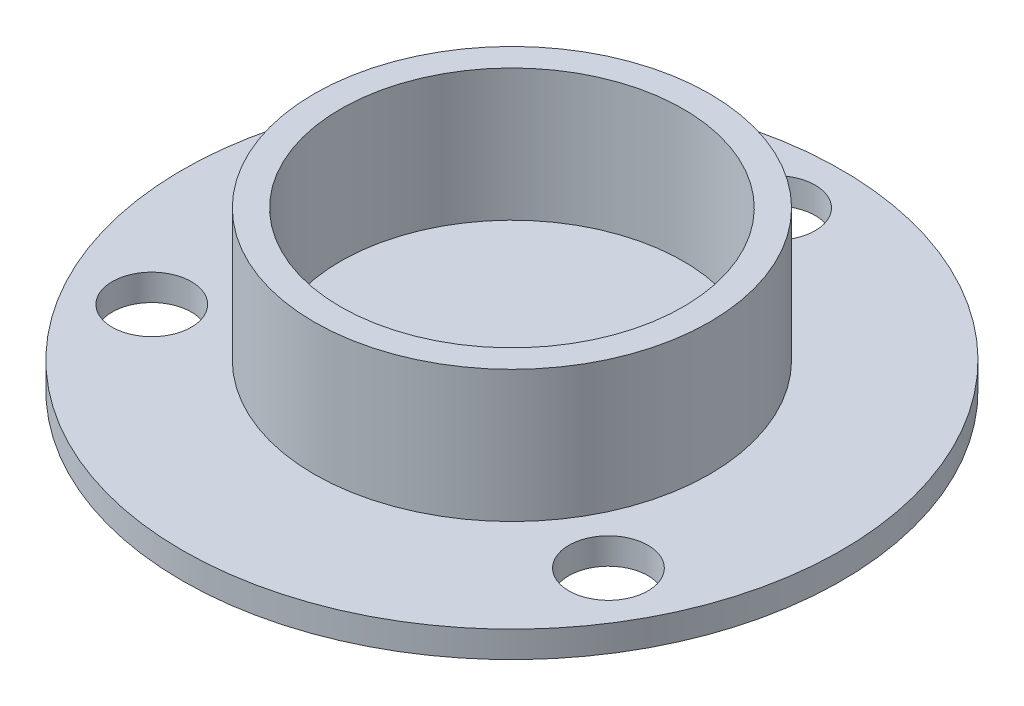
ISO-10303-21;
HEADER;
FILE_DESCRIPTION(('STEP AP214'),'2;1');
FILE_NAME('part.step','',(''),(''),'','','');
FILE_SCHEMA(('AUTOMOTIVE_DESIGN { 1 0 10303 214 1 1 1 1 }'));
ENDSEC;
DATA;
#1=APPLICATION_CONTEXT('core data for automotive mechanical design processes');
#2=APPLICATION_PROTOCOL_DEFINITION('international standard','automotive_design',2000,#1);
#3=PRODUCT_CONTEXT('',#1,'mechanical');
#4=PRODUCT('Part','Part','',(#3));
#5=PRODUCT_RELATED_PRODUCT_CATEGORY('part','',(#4));
#6=PRODUCT_DEFINITION_FORMATION('','',#4);
#7=PRODUCT_DEFINITION_CONTEXT('part definition',#1,'design');
#8=PRODUCT_DEFINITION('design','',#6,#7);
#9=PRODUCT_DEFINITION_SHAPE('','',#8);
#10=(LENGTH_UNIT() NAMED_UNIT(*) SI_UNIT(.MILLI.,.METRE.));
#11=(NAMED_UNIT(*) PLANE_ANGLE_UNIT() SI_UNIT($,.RADIAN.));
#12=(NAMED_UNIT(*) SI_UNIT($,.STERADIAN.) SOLID_ANGLE_UNIT());
#13=UNCERTAINTY_MEASURE_WITH_UNIT(LENGTH_MEASURE(1.E-05),#10,'distance_accuracy_value','');
#14=(GEOMETRIC_REPRESENTATION_CONTEXT(3) GLOBAL_UNCERTAINTY_ASSIGNED_CONTEXT((#13)) GLOBAL_UNIT_ASSIGNED_CONTEXT((#10,
#11,#12)) REPRESENTATION_CONTEXT('',''));
#15=CARTESIAN_POINT('',(0.,0.,0.));
#16=DIRECTION('',(0.,0.,1.));
#17=DIRECTION('',(1.,0.,0.));
#18=AXIS2_PLACEMENT_3D('',#15,#16,#17);
#19=CARTESIAN_POINT('',(0.,1.,0.));
#20=DIRECTION('',(0.,1.,0.));
#21=DIRECTION('',(0.,0.,1.));
#22=AXIS2_PLACEMENT_3D('',#19,#20,#21);
#23=PLANE('',#22);
#24=CARTESIAN_POINT('',(0.,1.,0.));
#25=DIRECTION('',(0.,1.,0.));
#26=DIRECTION('',(0.,0.,1.));
#27=AXIS2_PLACEMENT_3D('',#24,#25,#26);
#28=CIRCLE('',#27,7.5);
#29=CARTESIAN_POINT('',(0.,1.,7.5));
#30=VERTEX_POINT('',#29);
#31=EDGE_CURVE('E67',#30,#30,#28,.T.);
#32=ORIENTED_EDGE('',*,*,#31,.F.);
#33=EDGE_LOOP('',(#32));
#34=FACE_BOUND('',#33,.T.);
#35=CARTESIAN_POINT('',(8.66025403784503,1.,4.99999999999962));
#36=DIRECTION('',(0.,1.,0.));
#37=DIRECTION('',(0.,0.,1.));
#38=AXIS2_PLACEMENT_3D('',#35,#36,#37);
#39=CIRCLE('',#38,1.50000000000055);
#40=CARTESIAN_POINT('',(8.66025403784503,1.,6.50000000000018));
#41=VERTEX_POINT('',#40);
#42=EDGE_CURVE('E52',#41,#41,#39,.T.);
#43=ORIENTED_EDGE('',*,*,#42,.F.);
#44=EDGE_LOOP('',(#43));
#45=FACE_BOUND('',#44,.T.);
#46=CARTESIAN_POINT('',(0.,1.,0.));
#47=DIRECTION('',(0.,1.,0.));
#48=DIRECTION('',(0.,0.,1.));
#49=AXIS2_PLACEMENT_3D('',#46,#47,#48);
#50=CIRCLE('',#49,12.5);
#51=CARTESIAN_POINT('',(0.,1.,12.5));
#52=VERTEX_POINT('',#51);
#53=EDGE_CURVE('E38',#52,#52,#50,.T.);
#54=ORIENTED_EDGE('',*,*,#53,.T.);
#55=EDGE_LOOP('',(#54));
#56=FACE_BOUND('',#55,.T.);
#57=CARTESIAN_POINT('',(0.,1.,-10.));
#58=DIRECTION('',(0.,1.,0.));
#59=DIRECTION('',(0.,0.,1.));
#60=AXIS2_PLACEMENT_3D('',#57,#58,#59);
#61=CIRCLE('',#60,1.5);
#62=CARTESIAN_POINT('',(0.,1.,-8.5));
#63=VERTEX_POINT('',#62);
#64=EDGE_CURVE('E47',#63,#63,#61,.T.);
#65=ORIENTED_EDGE('',*,*,#64,.F.);
#66=EDGE_LOOP('',(#65));
#67=FACE_BOUND('',#66,.T.);
#68=CARTESIAN_POINT('',(-8.66025403784375,1.,5.00000000000037));
#69=DIRECTION('',(0.,1.,0.));
#70=DIRECTION('',(0.,0.,1.));
#71=AXIS2_PLACEMENT_3D('',#68,#69,#70);
#72=CIRCLE('',#71,1.50000000000081);
#73=CARTESIAN_POINT('',(-8.66025403784375,1.,6.50000000000118));
#74=VERTEX_POINT('',#73);
#75=EDGE_CURVE('E58',#74,#74,#72,.T.);
#76=ORIENTED_EDGE('',*,*,#75,.F.);
#77=EDGE_LOOP('',(#76));
#78=FACE_BOUND('',#77,.T.);
#79=ADVANCED_FACE('F31',(#34,#45,#56,#67,#78),#23,.T.);
#80=CARTESIAN_POINT('',(0.,0.,0.));
#81=DIRECTION('',(0.,1.,0.));
#82=DIRECTION('',(0.,0.,1.));
#83=AXIS2_PLACEMENT_3D('',#80,#81,#82);
#84=PLANE('',#83);
#85=CARTESIAN_POINT('',(0.,0.,0.));
#86=DIRECTION('',(0.,1.,0.));
#87=DIRECTION('',(0.,0.,1.));
#88=AXIS2_PLACEMENT_3D('',#85,#86,#87);
#89=CIRCLE('',#88,12.5);
#90=CARTESIAN_POINT('',(0.,0.,12.5));
#91=VERTEX_POINT('',#90);
#92=EDGE_CURVE('E42',#91,#91,#89,.T.);
#93=ORIENTED_EDGE('',*,*,#92,.F.);
#94=EDGE_LOOP('',(#93));
#95=FACE_BOUND('',#94,.T.);
#96=CARTESIAN_POINT('',(0.,0.,-10.));
#97=DIRECTION('',(0.,1.,0.));
#98=DIRECTION('',(0.,0.,1.));
#99=AXIS2_PLACEMENT_3D('',#96,#97,#98);
#100=CIRCLE('',#99,1.5);
#101=CARTESIAN_POINT('',(0.,0.,-8.5));
#102=VERTEX_POINT('',#101);
#103=EDGE_CURVE('E49',#102,#102,#100,.T.);
#104=ORIENTED_EDGE('',*,*,#103,.T.);
#105=EDGE_LOOP('',(#104));
#106=FACE_BOUND('',#105,.T.);
#107=CARTESIAN_POINT('',(8.66025403784503,0.,4.99999999999962));
#108=DIRECTION('',(0.,1.,0.));
#109=DIRECTION('',(0.,0.,1.));
#110=AXIS2_PLACEMENT_3D('',#107,#108,#109);
#111=CIRCLE('',#110,1.50000000000055);
#112=CARTESIAN_POINT('',(8.66025403784503,0.,6.50000000000018));
#113=VERTEX_POINT('',#112);
#114=EDGE_CURVE('E55',#113,#113,#111,.T.);
#115=ORIENTED_EDGE('',*,*,#114,.T.);
#116=EDGE_LOOP('',(#115));
#117=FACE_BOUND('',#116,.T.);
#118=CARTESIAN_POINT('',(-8.66025403784375,0.,5.00000000000037));
#119=DIRECTION('',(0.,1.,0.));
#120=DIRECTION('',(0.,0.,1.));
#121=AXIS2_PLACEMENT_3D('',#118,#119,#120);
#122=CIRCLE('',#121,1.50000000000081);
#123=CARTESIAN_POINT('',(-8.66025403784375,0.,6.50000000000118));
#124=VERTEX_POINT('',#123);
#125=EDGE_CURVE('E61',#124,#124,#122,.T.);
#126=ORIENTED_EDGE('',*,*,#125,.T.);
#127=EDGE_LOOP('',(#126));
#128=FACE_BOUND('',#127,.T.);
#129=ADVANCED_FACE('F95',(#95,#106,#117,#128),#84,.F.);
#130=CARTESIAN_POINT('',(0.,1.,0.));
#131=DIRECTION('',(0.,-1.,0.));
#132=DIRECTION('',(0.,0.,-1.));
#133=AXIS2_PLACEMENT_3D('',#130,#131,#132);
#134=CYLINDRICAL_SURFACE('',#133,12.5);
#135=ORIENTED_EDGE('',*,*,#53,.F.);
#136=EDGE_LOOP('',(#135));
#137=FACE_BOUND('',#136,.T.);
#138=ORIENTED_EDGE('',*,*,#92,.T.);
#139=EDGE_LOOP('',(#138));
#140=FACE_BOUND('',#139,.T.);
#141=ADVANCED_FACE('F33',(#137,#140),#134,.T.);
#142=CARTESIAN_POINT('',(0.,1.,-10.));
#143=DIRECTION('',(0.,-1.,0.));
#144=DIRECTION('',(0.,0.,-1.));
#145=AXIS2_PLACEMENT_3D('',#142,#143,#144);
#146=CYLINDRICAL_SURFACE('',#145,1.5);
#147=ORIENTED_EDGE('',*,*,#64,.T.);
#148=EDGE_LOOP('',(#147));
#149=FACE_BOUND('',#148,.T.);
#150=ORIENTED_EDGE('',*,*,#103,.F.);
#151=EDGE_LOOP('',(#150));
#152=FACE_BOUND('',#151,.T.);
#153=ADVANCED_FACE('F142',(#149,#152),#146,.F.);
#154=CARTESIAN_POINT('',(8.66025403784503,1.,4.99999999999962));
#155=DIRECTION('',(0.,-1.,0.));
#156=DIRECTION('',(0.,0.,-1.));
#157=AXIS2_PLACEMENT_3D('',#154,#155,#156);
#158=CYLINDRICAL_SURFACE('',#157,1.50000000000055);
#159=ORIENTED_EDGE('',*,*,#42,.T.);
#160=EDGE_LOOP('',(#159));
#161=FACE_BOUND('',#160,.T.);
#162=ORIENTED_EDGE('',*,*,#114,.F.);
#163=EDGE_LOOP('',(#162));
#164=FACE_BOUND('',#163,.T.);
#165=ADVANCED_FACE('F90',(#161,#164),#158,.F.);
#166=CARTESIAN_POINT('',(-8.66025403784375,1.,5.00000000000037));
#167=DIRECTION('',(0.,-1.,0.));
#168=DIRECTION('',(0.,0.,-1.));
#169=AXIS2_PLACEMENT_3D('',#166,#167,#168);
#170=CYLINDRICAL_SURFACE('',#169,1.50000000000081);
#171=ORIENTED_EDGE('',*,*,#75,.T.);
#172=EDGE_LOOP('',(#171));
#173=FACE_BOUND('',#172,.T.);
#174=ORIENTED_EDGE('',*,*,#125,.F.);
#175=EDGE_LOOP('',(#174));
#176=FACE_BOUND('',#175,.T.);
#177=ADVANCED_FACE('F81',(#173,#176),#170,.F.);
#178=CARTESIAN_POINT('',(0.,6.,0.));
#179=DIRECTION('',(0.,1.,0.));
#180=DIRECTION('',(0.,0.,1.));
#181=AXIS2_PLACEMENT_3D('',#178,#179,#180);
#182=PLANE('',#181);
#183=CARTESIAN_POINT('',(0.,6.,0.));
#184=DIRECTION('',(0.,1.,0.));
#185=DIRECTION('',(0.,0.,1.));
#186=AXIS2_PLACEMENT_3D('',#183,#184,#185);
#187=CIRCLE('',#186,7.5);
#188=CARTESIAN_POINT('',(0.,6.,7.5));
#189=VERTEX_POINT('',#188);
#190=EDGE_CURVE('E64',#189,#189,#187,.T.);
#191=ORIENTED_EDGE('',*,*,#190,.T.);
#192=EDGE_LOOP('',(#191));
#193=FACE_BOUND('',#192,.T.);
#194=CARTESIAN_POINT('',(0.,6.,0.));
#195=DIRECTION('',(0.,1.,0.));
#196=DIRECTION('',(0.,0.,1.));
#197=AXIS2_PLACEMENT_3D('',#194,#195,#196);
#198=CIRCLE('',#197,6.5);
#199=CARTESIAN_POINT('',(0.,6.,6.5));
#200=VERTEX_POINT('',#199);
#201=EDGE_CURVE('E70',#200,#200,#198,.T.);
#202=ORIENTED_EDGE('',*,*,#201,.F.);
#203=EDGE_LOOP('',(#202));
#204=FACE_BOUND('',#203,.T.);
#205=ADVANCED_FACE('F78',(#193,#204),#182,.T.);
#206=CARTESIAN_POINT('',(0.,6.,0.));
#207=DIRECTION('',(0.,-1.,0.));
#208=DIRECTION('',(0.,0.,-1.));
#209=AXIS2_PLACEMENT_3D('',#206,#207,#208);
#210=CYLINDRICAL_SURFACE('',#209,7.5);
#211=ORIENTED_EDGE('',*,*,#190,.F.);
#212=EDGE_LOOP('',(#211));
#213=FACE_BOUND('',#212,.T.);
#214=ORIENTED_EDGE('',*,*,#31,.T.);
#215=EDGE_LOOP('',(#214));
#216=FACE_BOUND('',#215,.T.);
#217=ADVANCED_FACE('F80',(#213,#216),#210,.T.);
#218=CARTESIAN_POINT('',(0.,6.,0.));
#219=DIRECTION('',(0.,-1.,0.));
#220=DIRECTION('',(0.,0.,-1.));
#221=AXIS2_PLACEMENT_3D('',#218,#219,#220);
#222=CYLINDRICAL_SURFACE('',#221,6.5);
#223=ORIENTED_EDGE('',*,*,#201,.T.);
#224=EDGE_LOOP('',(#223));
#225=FACE_BOUND('',#224,.T.);
#226=CARTESIAN_POINT('',(0.,1.,0.));
#227=DIRECTION('',(0.,1.,0.));
#228=DIRECTION('',(0.,0.,1.));
#229=AXIS2_PLACEMENT_3D('',#226,#227,#228);
#230=CIRCLE('',#229,6.5);
#231=CARTESIAN_POINT('',(0.,1.,6.5));
#232=VERTEX_POINT('',#231);
#233=EDGE_CURVE('E10',#232,#232,#230,.F.);
#234=ORIENTED_EDGE('',*,*,#233,.T.);
#235=EDGE_LOOP('',(#234));
#236=FACE_BOUND('',#235,.T.);
#237=ADVANCED_FACE('F76',(#225,#236),#222,.F.);
#238=ORIENTED_EDGE('',*,*,#233,.F.);
#239=EDGE_LOOP('',(#238));
#240=FACE_BOUND('',#239,.T.);
#241=ADVANCED_FACE('F98',(#240),#23,.T.);
#242=CLOSED_SHELL('',(#79,#129,#141,#153,#165,#177,#205,#217,#237,#241));
#243=MANIFOLD_SOLID_BREP('B2',#242);
#244=ADVANCED_BREP_SHAPE_REPRESENTATION('',(#18,#243),#14);
#245=SHAPE_DEFINITION_REPRESENTATION(#9,#244);
ENDSEC;
END-ISO-10303-21;
